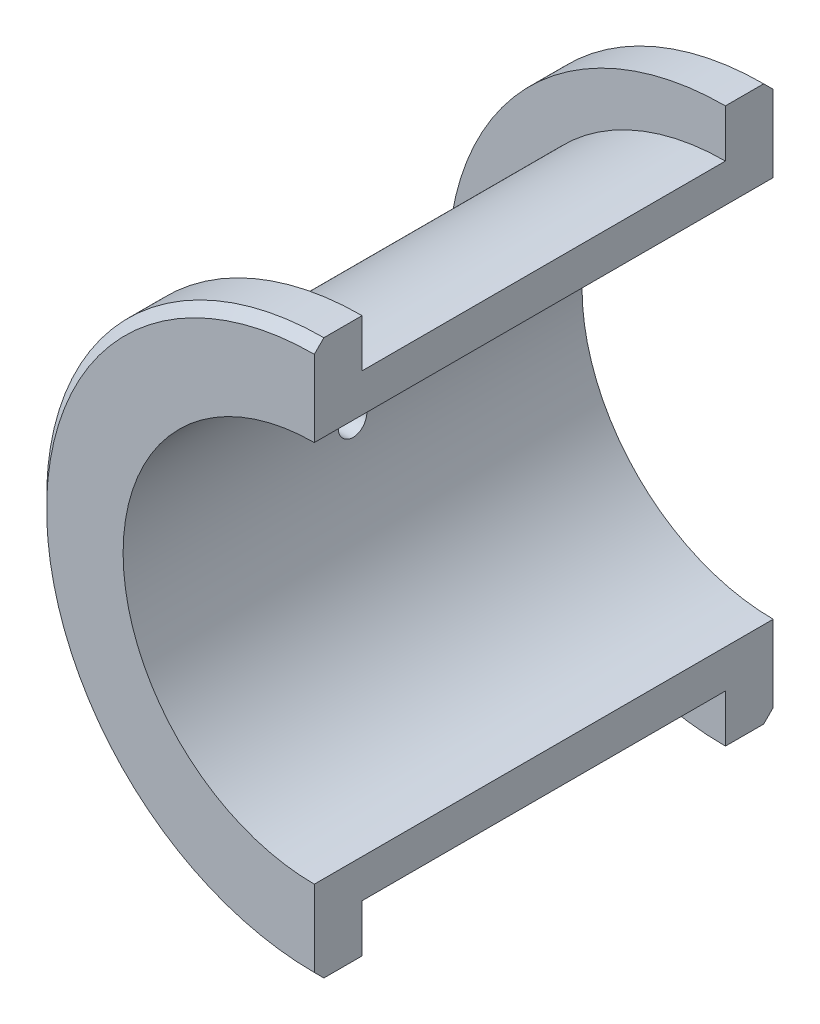
ISO-10303-21;
HEADER;
FILE_DESCRIPTION(('STEP AP214'),'2;1');
FILE_NAME('part.step','',(''),(''),'','','');
FILE_SCHEMA(('AUTOMOTIVE_DESIGN { 1 0 10303 214 1 1 1 1 }'));
ENDSEC;
DATA;
#1=APPLICATION_CONTEXT('core data for automotive mechanical design processes');
#2=APPLICATION_PROTOCOL_DEFINITION('international standard','automotive_design',2000,#1);
#3=PRODUCT_CONTEXT('',#1,'mechanical');
#4=PRODUCT('Part','Part','',(#3));
#5=PRODUCT_RELATED_PRODUCT_CATEGORY('part','',(#4));
#6=PRODUCT_DEFINITION_FORMATION('','',#4);
#7=PRODUCT_DEFINITION_CONTEXT('part definition',#1,'design');
#8=PRODUCT_DEFINITION('design','',#6,#7);
#9=PRODUCT_DEFINITION_SHAPE('','',#8);
#10=(LENGTH_UNIT() NAMED_UNIT(*) SI_UNIT(.MILLI.,.METRE.));
#11=(NAMED_UNIT(*) PLANE_ANGLE_UNIT() SI_UNIT($,.RADIAN.));
#12=(NAMED_UNIT(*) SI_UNIT($,.STERADIAN.) SOLID_ANGLE_UNIT());
#13=UNCERTAINTY_MEASURE_WITH_UNIT(LENGTH_MEASURE(1.E-05),#10,'distance_accuracy_value','');
#14=(GEOMETRIC_REPRESENTATION_CONTEXT(3) GLOBAL_UNCERTAINTY_ASSIGNED_CONTEXT((#13)) GLOBAL_UNIT_ASSIGNED_CONTEXT((#10,
#11,#12)) REPRESENTATION_CONTEXT('',''));
#15=CARTESIAN_POINT('',(0.,0.,0.));
#16=DIRECTION('',(0.,0.,1.));
#17=DIRECTION('',(1.,0.,0.));
#18=AXIS2_PLACEMENT_3D('',#15,#16,#17);
#19=CARTESIAN_POINT('',(0.,0.,24.));
#20=DIRECTION('',(0.,0.,-1.));
#21=DIRECTION('',(-1.,0.,0.));
#22=AXIS2_PLACEMENT_3D('',#19,#20,#21);
#23=CYLINDRICAL_SURFACE('',#22,24.);
#24=CARTESIAN_POINT('',(0.,0.,19.));
#25=DIRECTION('',(0.,0.,1.));
#26=DIRECTION('',(1.,0.,0.));
#27=AXIS2_PLACEMENT_3D('',#24,#25,#26);
#28=CIRCLE('',#27,24.);
#29=CARTESIAN_POINT('',(0.,24.,19.));
#30=VERTEX_POINT('',#29);
#31=CARTESIAN_POINT('',(0.,-24.,19.));
#32=VERTEX_POINT('',#31);
#33=EDGE_CURVE('E161',#30,#32,#28,.T.);
#34=ORIENTED_EDGE('',*,*,#33,.F.);
#35=DIRECTION('',(0.,0.,-1.));
#36=VECTOR('',#35,1.);
#37=CARTESIAN_POINT('',(0.,24.,24.));
#38=LINE('',#37,#36);
#39=CARTESIAN_POINT('',(0.,24.,-19.));
#40=VERTEX_POINT('',#39);
#41=EDGE_CURVE('E196',#30,#40,#38,.T.);
#42=ORIENTED_EDGE('',*,*,#41,.T.);
#43=CARTESIAN_POINT('',(0.,0.,-19.));
#44=DIRECTION('',(0.,0.,1.));
#45=DIRECTION('',(1.,0.,0.));
#46=AXIS2_PLACEMENT_3D('',#43,#44,#45);
#47=CIRCLE('',#46,24.);
#48=CARTESIAN_POINT('',(0.,-24.,-19.));
#49=VERTEX_POINT('',#48);
#50=EDGE_CURVE('E147',#40,#49,#47,.T.);
#51=ORIENTED_EDGE('',*,*,#50,.T.);
#52=DIRECTION('',(0.,0.,-1.));
#53=VECTOR('',#52,1.);
#54=CARTESIAN_POINT('',(0.,-24.,24.));
#55=LINE('',#54,#53);
#56=EDGE_CURVE('E135',#49,#32,#55,.F.);
#57=ORIENTED_EDGE('',*,*,#56,.T.);
#58=EDGE_LOOP('',(#34,#42,#51,#57));
#59=FACE_BOUND('',#58,.T.);
#60=CARTESIAN_POINT('',(-24.,0.,4.));
#61=CARTESIAN_POINT('',(-23.9999961787012,0.223025447933143,3.9999910576835));
#62=CARTESIAN_POINT('',(-23.9968588466085,0.446172610942113,3.98128436004973));
#63=CARTESIAN_POINT('',(-23.9846455190622,0.886208354676868,3.90698294597548));
#64=CARTESIAN_POINT('',(-23.9755640627822,1.10309098873479,3.85135430894143));
#65=CARTESIAN_POINT('',(-23.9524810917832,1.52416759554023,3.70493528225159));
#66=CARTESIAN_POINT('',(-23.9384836025471,1.72837178949104,3.61417365497508));
#67=CARTESIAN_POINT('',(-23.9071076333131,2.11862694716471,3.40014033271617));
#68=CARTESIAN_POINT('',(-23.8897295400709,2.30467998380575,3.2768723560272));
#69=CARTESIAN_POINT('',(-23.853333079333,2.65515618286669,3.00007186588727));
#70=CARTESIAN_POINT('',(-23.8343019490377,2.81938064565595,2.84628941658219));
#71=CARTESIAN_POINT('',(-23.7968420300277,3.11982159785588,2.5133632504435));
#72=CARTESIAN_POINT('',(-23.7784132794027,3.25603631902555,2.33421793366942));
#73=CARTESIAN_POINT('',(-23.7441210521565,3.49738740096821,1.95428645408471));
#74=CARTESIAN_POINT('',(-23.7282740654662,3.6023272845776,1.75337386111239));
#75=CARTESIAN_POINT('',(-23.7011166367148,3.77689338465795,1.336464697119));
#76=CARTESIAN_POINT('',(-23.6898058882289,3.84652198650498,1.12046914611579));
#77=CARTESIAN_POINT('',(-23.6731285894841,3.94786300445569,0.681631560229534));
#78=CARTESIAN_POINT('',(-23.6677082957712,3.97991844661664,0.45887082159777));
#79=CARTESIAN_POINT('',(-23.6632630229864,4.0062667604638,0.011071556986445));
#80=CARTESIAN_POINT('',(-23.6642375913154,4.00056230462239,-0.213966806667679));
#81=CARTESIAN_POINT('',(-23.6724228618169,3.95183215743384,-0.657484578040717));
#82=CARTESIAN_POINT('',(-23.6795691731027,3.90919181102364,-0.876007685672373));
#83=CARTESIAN_POINT('',(-23.6991919233761,3.78840502464551,-1.30275410852661));
#84=CARTESIAN_POINT('',(-23.7116685451723,3.71025736691159,-1.51097707022167));
#85=CARTESIAN_POINT('',(-23.7406156693456,3.52028359375026,-1.91236611750547));
#86=CARTESIAN_POINT('',(-23.7571050737172,3.40829746220754,-2.10545504972996));
#87=CARTESIAN_POINT('',(-23.7922066946401,3.15393922809189,-2.47024704086142));
#88=CARTESIAN_POINT('',(-23.8108190824686,3.01156467304686,-2.64194837192789));
#89=CARTESIAN_POINT('',(-23.8483524460766,2.69837153945449,-2.96132173729176));
#90=CARTESIAN_POINT('',(-23.8672743877064,2.527222342197,-3.10866962966413));
#91=CARTESIAN_POINT('',(-23.9030816223476,2.16245639837063,-3.37260442026454));
#92=CARTESIAN_POINT('',(-23.9199669022359,1.96883950705028,-3.48919112029316));
#93=CARTESIAN_POINT('',(-23.9498222862866,1.56432946586674,-3.68832356341805));
#94=CARTESIAN_POINT('',(-23.9627890945192,1.35342196090346,-3.77084067093001));
#95=CARTESIAN_POINT('',(-23.9833200482026,0.920477352964371,-3.89919074439356));
#96=CARTESIAN_POINT('',(-23.9908846456076,0.69844118268715,-3.94502677915795));
#97=CARTESIAN_POINT('',(-23.999698077483,0.252335842082598,-3.99827417353781));
#98=CARTESIAN_POINT('',(-24.0010200482045,0.0283211794416183,-4.00613051488897));
#99=CARTESIAN_POINT('',(-23.9973995907387,-0.41782363662382,-3.984381848915));
#100=CARTESIAN_POINT('',(-23.9924574035859,-0.639953862227262,-3.95477828298602));
#101=CARTESIAN_POINT('',(-23.9769092310112,-1.07464988087482,-3.85932024106323));
#102=CARTESIAN_POINT('',(-23.966337676821,-1.28726538941661,-3.7936860665758));
#103=CARTESIAN_POINT('',(-23.9407114312857,-1.69847501577671,-3.62826477088075));
#104=CARTESIAN_POINT('',(-23.9256564881923,-1.89706834545555,-3.52847573178357));
#105=CARTESIAN_POINT('',(-23.8925522608385,-2.27652910315033,-3.29655820048514));
#106=CARTESIAN_POINT('',(-23.8744776941924,-2.45722440149943,-3.1641517501324));
#107=CARTESIAN_POINT('',(-23.8374154782704,-2.7939897368043,-2.87114029538391));
#108=CARTESIAN_POINT('',(-23.8184277627448,-2.95005798351453,-2.71053324275733));
#109=CARTESIAN_POINT('',(-23.7814428037735,-3.2347884474528,-2.36368392308572));
#110=CARTESIAN_POINT('',(-23.7634578581937,-3.36315001778194,-2.17719333517694));
#111=CARTESIAN_POINT('',(-23.7307444764461,-3.58672369647198,-1.78503524937834));
#112=CARTESIAN_POINT('',(-23.7160159370563,-3.68193685563172,-1.57936835963601));
#113=CARTESIAN_POINT('',(-23.6915752591633,-3.83606133035704,-1.15553642750059));
#114=CARTESIAN_POINT('',(-23.681842468977,-3.89512229207671,-0.93742704795122));
#115=CARTESIAN_POINT('',(-23.6684434693642,-3.97573672604524,-0.494207793245183));
#116=CARTESIAN_POINT('',(-23.6647767325235,-3.99729345911387,-0.26909852842872));
#117=CARTESIAN_POINT('',(-23.6639477293442,-4.00219658567576,0.178728265539851));
#118=CARTESIAN_POINT('',(-23.6667049040904,-3.9860162178003,0.401440605720457));
#119=CARTESIAN_POINT('',(-23.6782365032597,-3.91692774233096,0.840926796881219));
#120=CARTESIAN_POINT('',(-23.6870109081794,-3.86401975377996,1.05770066710699));
#121=CARTESIAN_POINT('',(-23.7095577005075,-3.72315918335184,1.47897349966818));
#122=CARTESIAN_POINT('',(-23.7233242755147,-3.63524734496071,1.68348641608964));
#123=CARTESIAN_POINT('',(-23.7543099027553,-3.42692320626546,2.07493707071175));
#124=CARTESIAN_POINT('',(-23.7715291262144,-3.3065092939977,2.26187393659541));
#125=CARTESIAN_POINT('',(-23.80773526473,-3.03491021499545,2.61525693297241));
#126=CARTESIAN_POINT('',(-23.8267407292208,-2.88337690174984,2.78143362672044));
#127=CARTESIAN_POINT('',(-23.8642299577734,-2.55457445020837,3.0861625671599));
#128=CARTESIAN_POINT('',(-23.8827136004247,-2.37729938066022,3.22470842982107));
#129=CARTESIAN_POINT('',(-23.9172244742755,-2.00059067142445,3.47111722911991));
#130=CARTESIAN_POINT('',(-23.9332338600497,-1.80101246005251,3.57876166290072));
#131=CARTESIAN_POINT('',(-23.9608186816284,-1.38642091100637,3.75883117537587));
#132=CARTESIAN_POINT('',(-23.9723985308397,-1.17142319172802,3.83129132972752));
#133=CARTESIAN_POINT('',(-23.9872926533273,-0.796325296072641,3.92320843860266));
#134=CARTESIAN_POINT('',(-23.9920324363737,-0.638494128477516,3.95195915138554));
#135=CARTESIAN_POINT('',(-23.9983874557779,-0.320462896511695,3.9903579805516));
#136=CARTESIAN_POINT('',(-24.0000027459303,-0.160262872973591,4.00000642581978));
#137=CARTESIAN_POINT('',(-24.,0.,4.));
#138=B_SPLINE_CURVE_WITH_KNOTS('',3,(#60,#61,#62,#63,#64,#65,#66,#67,#68,#69,#70,#71,#72,#73,
#74,#75,#76,#77,#78,#79,#80,#81,#82,#83,#84,#85,#86,#87,#88,#89,#90,#91,#92,#93,#94,#95,#96,#97,
#98,#99,#100,#101,#102,#103,#104,#105,#106,#107,#108,#109,#110,#111,#112,#113,#114,#115,#116,
#117,#118,#119,#120,#121,#122,#123,#124,#125,#126,#127,#128,#129,#130,#131,#132,#133,#134,#135,
#136,#137),.UNSPECIFIED.,.T.,.F.,(4,2,2,2,2,2,2,2,2,2,2,2,2,2,2,2,2,2,2,2,2,2,2,2,2,2,2,2,2,2,2,
2,2,2,2,2,2,2,4),(0.,0.668490535901615,1.33759607311267,2.00615498724043,2.67463746027966,
3.34883985699731,4.02308480271771,4.70148033318144,5.3798300300189,6.05193723365478,
6.72399686913418,7.38912834816654,8.0542826404061,8.72263290612092,9.39103713088918,
10.0677243185812,10.7444158661736,11.4216750226545,12.0988775123384,12.7681261358624,
13.4373490085738,14.1025249121026,14.7677381732171,15.4388292100324,16.1099690088685,
16.7880611521219,17.4661317980151,18.1413763574683,18.8165622045859,19.4833265523632,
20.1500887390101,20.8160770916196,21.4820984804694,22.1560221470943,22.8301013420636,
23.5088357057152,24.1868920340812,24.6672679706243,25.1476356364315),.UNSPECIFIED.);
#139=CARTESIAN_POINT('',(-24.,0.,4.));
#140=VERTEX_POINT('',#139);
#141=EDGE_CURVE('E11',#140,#140,#138,.T.);
#142=ORIENTED_EDGE('',*,*,#141,.F.);
#143=EDGE_LOOP('',(#142));
#144=FACE_BOUND('',#143,.T.);
#145=ADVANCED_FACE('F36',(#59,#144),#23,.T.);
#146=CARTESIAN_POINT('',(0.,0.,19.));
#147=DIRECTION('',(0.,0.,1.));
#148=DIRECTION('',(1.,0.,0.));
#149=AXIS2_PLACEMENT_3D('',#146,#147,#148);
#150=CYLINDRICAL_SURFACE('',#149,29.);
#151=DIRECTION('',(0.,0.,1.));
#152=VECTOR('',#151,1.);
#153=CARTESIAN_POINT('',(0.,-29.,-24.));
#154=LINE('',#153,#152);
#155=CARTESIAN_POINT('',(0.,-29.,19.));
#156=VERTEX_POINT('',#155);
#157=CARTESIAN_POINT('',(0.,-29.,23.));
#158=VERTEX_POINT('',#157);
#159=EDGE_CURVE('E129',#156,#158,#154,.T.);
#160=ORIENTED_EDGE('',*,*,#159,.T.);
#161=CARTESIAN_POINT('',(0.,0.,23.));
#162=DIRECTION('',(0.,0.,1.));
#163=DIRECTION('',(1.,0.,0.));
#164=AXIS2_PLACEMENT_3D('',#161,#162,#163);
#165=CIRCLE('',#164,29.);
#166=CARTESIAN_POINT('',(0.,29.,23.));
#167=VERTEX_POINT('',#166);
#168=EDGE_CURVE('E48',#158,#167,#165,.F.);
#169=ORIENTED_EDGE('',*,*,#168,.T.);
#170=DIRECTION('',(0.,0.,1.));
#171=VECTOR('',#170,1.);
#172=CARTESIAN_POINT('',(0.,29.,-24.));
#173=LINE('',#172,#171);
#174=CARTESIAN_POINT('',(0.,29.,19.));
#175=VERTEX_POINT('',#174);
#176=EDGE_CURVE('E128',#175,#167,#173,.T.);
#177=ORIENTED_EDGE('',*,*,#176,.F.);
#178=CARTESIAN_POINT('',(0.,0.,19.));
#179=DIRECTION('',(0.,0.,1.));
#180=DIRECTION('',(1.,0.,0.));
#181=AXIS2_PLACEMENT_3D('',#178,#179,#180);
#182=CIRCLE('',#181,29.);
#183=EDGE_CURVE('E155',#175,#156,#182,.T.);
#184=ORIENTED_EDGE('',*,*,#183,.T.);
#185=EDGE_LOOP('',(#160,#169,#177,#184));
#186=FACE_BOUND('',#185,.T.);
#187=ADVANCED_FACE('F209',(#186),#150,.T.);
#188=CARTESIAN_POINT('',(0.,0.,24.));
#189=DIRECTION('',(0.,0.,1.));
#190=DIRECTION('',(1.,0.,0.));
#191=AXIS2_PLACEMENT_3D('',#188,#189,#190);
#192=PLANE('',#191);
#193=DIRECTION('',(0.,-1.,0.));
#194=VECTOR('',#193,1.);
#195=CARTESIAN_POINT('',(0.,-29.,24.));
#196=LINE('',#195,#194);
#197=CARTESIAN_POINT('',(0.,28.,24.));
#198=VERTEX_POINT('',#197);
#199=CARTESIAN_POINT('',(0.,20.,24.));
#200=VERTEX_POINT('',#199);
#201=EDGE_CURVE('E183',#198,#200,#196,.T.);
#202=ORIENTED_EDGE('',*,*,#201,.F.);
#203=CARTESIAN_POINT('',(0.,0.,24.));
#204=DIRECTION('',(0.,0.,1.));
#205=DIRECTION('',(1.,0.,0.));
#206=AXIS2_PLACEMENT_3D('',#203,#204,#205);
#207=CIRCLE('',#206,28.);
#208=CARTESIAN_POINT('',(0.,-28.,24.));
#209=VERTEX_POINT('',#208);
#210=EDGE_CURVE('E174',#198,#209,#207,.T.);
#211=ORIENTED_EDGE('',*,*,#210,.T.);
#212=CARTESIAN_POINT('',(0.,-20.,24.));
#213=VERTEX_POINT('',#212);
#214=EDGE_CURVE('E182',#213,#209,#196,.T.);
#215=ORIENTED_EDGE('',*,*,#214,.F.);
#216=CARTESIAN_POINT('',(0.,0.,24.));
#217=DIRECTION('',(0.,0.,1.));
#218=DIRECTION('',(1.,0.,0.));
#219=AXIS2_PLACEMENT_3D('',#216,#217,#218);
#220=CIRCLE('',#219,20.);
#221=EDGE_CURVE('E158',#200,#213,#220,.T.);
#222=ORIENTED_EDGE('',*,*,#221,.F.);
#223=EDGE_LOOP('',(#202,#211,#215,#222));
#224=FACE_BOUND('',#223,.T.);
#225=ADVANCED_FACE('F180',(#224),#192,.T.);
#226=CARTESIAN_POINT('',(0.,0.,24.));
#227=DIRECTION('',(0.,0.,-1.));
#228=DIRECTION('',(-1.,0.,0.));
#229=AXIS2_PLACEMENT_3D('',#226,#227,#228);
#230=CYLINDRICAL_SURFACE('',#229,20.);
#231=CARTESIAN_POINT('',(-20.,0.,-1.5));
#232=CARTESIAN_POINT('',(-19.9999992582729,0.0841288095114431,-1.49999631318298));
#233=CARTESIAN_POINT('',(-19.9994635090758,0.168315601024087,-1.49289854655941));
#234=CARTESIAN_POINT('',(-19.9973778078798,0.334361941971538,-1.46468751545672));
#235=CARTESIAN_POINT('',(-19.9958266932389,0.416218711162994,-1.44355818376302));
#236=CARTESIAN_POINT('',(-19.9918856268593,0.575175965959818,-1.38789667188027));
#237=CARTESIAN_POINT('',(-19.9894961359011,0.652279036935091,-1.3533718528915));
#238=CARTESIAN_POINT('',(-19.9841466247064,0.799576480678019,-1.27191204713627));
#239=CARTESIAN_POINT('',(-19.9811867302827,0.86977237179985,-1.22497979620403));
#240=CARTESIAN_POINT('',(-19.975021868989,1.00142895753255,-1.11993077946249));
#241=CARTESIAN_POINT('',(-19.971816458291,1.06287322971852,-1.06179345591578));
#242=CARTESIAN_POINT('',(-19.9655255838438,1.17514165369782,-0.936027702655082));
#243=CARTESIAN_POINT('',(-19.9624401252546,1.22596534904266,-0.868398865225933));
#244=CARTESIAN_POINT('',(-19.9567335395977,1.31560383874766,-0.725472545190602));
#245=CARTESIAN_POINT('',(-19.954112961772,1.35440446810332,-0.650166154969908));
#246=CARTESIAN_POINT('',(-19.9496376121017,1.41880489046782,-0.494084627656202));
#247=CARTESIAN_POINT('',(-19.947782829037,1.44440487688688,-0.41330957070739));
#248=CARTESIAN_POINT('',(-19.9450525889002,1.48163037657928,-0.248746107599445));
#249=CARTESIAN_POINT('',(-19.9441752805014,1.49328231044217,-0.164963709192381));
#250=CARTESIAN_POINT('',(-19.9434933892539,1.50236254574838,0.00337195326069861));
#251=CARTESIAN_POINT('',(-19.943688789744,1.49979106810858,0.0879252053135138));
#252=CARTESIAN_POINT('',(-19.9451285636931,1.48051934417569,0.255221811053888));
#253=CARTESIAN_POINT('',(-19.9463708093904,1.46384775676394,0.337968486964174));
#254=CARTESIAN_POINT('',(-19.9497609519804,1.4168935522692,0.499485697115581));
#255=CARTESIAN_POINT('',(-19.9519088562398,1.38661082447336,0.578256199008755));
#256=CARTESIAN_POINT('',(-19.9568707353614,1.31326167189701,0.729676716238837));
#257=CARTESIAN_POINT('',(-19.9596853828031,1.27018232726496,0.802320450176808));
#258=CARTESIAN_POINT('',(-19.9656629459514,1.17247213743423,0.939356662864872));
#259=CARTESIAN_POINT('',(-19.9688258673499,1.11784110342877,1.00374900672235));
#260=CARTESIAN_POINT('',(-19.9751530336147,0.998417278432274,1.12262125824358));
#261=CARTESIAN_POINT('',(-19.978317262423,0.933599700176314,1.17707626759472));
#262=CARTESIAN_POINT('',(-19.9842830152099,0.795729375934442,1.2743357635657));
#263=CARTESIAN_POINT('',(-19.9870845390023,0.72267662571859,1.31714024420127));
#264=CARTESIAN_POINT('',(-19.9920096041928,0.570393940216334,1.38988183024377));
#265=CARTESIAN_POINT('',(-19.9941330911371,0.491163509428978,1.41981790224129));
#266=CARTESIAN_POINT('',(-19.9974621500133,0.328781652774543,1.46595581220485));
#267=CARTESIAN_POINT('',(-19.998667737375,0.245630292842573,1.48215788103766));
#268=CARTESIAN_POINT('',(-20.0000231735387,0.0779828437837497,1.50033680953895));
#269=CARTESIAN_POINT('',(-20.0001755757578,-0.00650949482532217,1.50234807465418));
#270=CARTESIAN_POINT('',(-19.9994142771364,-0.174630230993065,1.49217833193029));
#271=CARTESIAN_POINT('',(-19.9985005843262,-0.258258635054598,1.47999743099469));
#272=CARTESIAN_POINT('',(-19.9957115375324,-0.422180011176505,1.44181763118942));
#273=CARTESIAN_POINT('',(-19.9938372886011,-0.502476701646071,1.41583460944133));
#274=CARTESIAN_POINT('',(-19.989337809084,-0.65757032738403,1.35080430636328));
#275=CARTESIAN_POINT('',(-19.9867125688255,-0.732367191799398,1.31175685676318));
#276=CARTESIAN_POINT('',(-19.9809993255836,-0.87449495937676,1.22161916210213));
#277=CARTESIAN_POINT('',(-19.9779104477497,-0.941811320255548,1.17050604328117));
#278=CARTESIAN_POINT('',(-19.9716201639251,-1.06692059601702,1.05772107453092));
#279=CARTESIAN_POINT('',(-19.9684187563498,-1.1247133767348,0.996049075876741));
#280=CARTESIAN_POINT('',(-19.9622567375937,-1.22925234979154,0.863748059867883));
#281=CARTESIAN_POINT('',(-19.9592966224009,-1.27597614708765,0.793101320567015));
#282=CARTESIAN_POINT('',(-19.9539590285433,-1.35689744472608,0.644944801618456));
#283=CARTESIAN_POINT('',(-19.951581545017,-1.39109504958689,0.567435079242164));
#284=CARTESIAN_POINT('',(-19.9476809567371,-1.44595479238458,0.407833192512691));
#285=CARTESIAN_POINT('',(-19.9461569763152,-1.46663080672911,0.325745820147273));
#286=CARTESIAN_POINT('',(-19.9441328652441,-1.49390569339177,0.159252768984275));
#287=CARTESIAN_POINT('',(-19.9436327190765,-1.50050477907388,0.0748471253443678));
#288=CARTESIAN_POINT('',(-19.9437130691626,-1.49943621553155,-0.0936639132474086));
#289=CARTESIAN_POINT('',(-19.9442908995857,-1.49180376085723,-0.177769534896141));
#290=CARTESIAN_POINT('',(-19.9464564369575,-1.46256198193398,-0.343501083710002));
#291=CARTESIAN_POINT('',(-19.9480441455862,-1.44095263443385,-0.425127006749805));
#292=CARTESIAN_POINT('',(-19.952049853556,-1.38437900273526,-0.583585608421792));
#293=CARTESIAN_POINT('',(-19.9544678255495,-1.34941515840954,-0.660418444832537));
#294=CARTESIAN_POINT('',(-19.9598616237908,-1.26712924619683,-0.807128957714564));
#295=CARTESIAN_POINT('',(-19.9628374388208,-1.21980742681008,-0.877006774001796));
#296=CARTESIAN_POINT('',(-19.9690203079162,-1.11401708946727,-1.00800334997103));
#297=CARTESIAN_POINT('',(-19.972227887963,-1.05552268820001,-1.0691011816401));
#298=CARTESIAN_POINT('',(-19.9785081329158,-0.929090973452718,-1.18063405031084));
#299=CARTESIAN_POINT('',(-19.9815807648333,-0.861151367795686,-1.23106649150607));
#300=CARTESIAN_POINT('',(-19.9872494022766,-0.717650416603838,-1.31989116253911));
#301=CARTESIAN_POINT('',(-19.9898446437752,-0.642077148267444,-1.35826416049103));
#302=CARTESIAN_POINT('',(-19.9942566719576,-0.485593917915209,-1.42172828444031));
#303=CARTESIAN_POINT('',(-19.9960743603405,-0.404690263737666,-1.44683480306826));
#304=CARTESIAN_POINT('',(-19.9982556200579,-0.26941791672437,-1.47660198852695));
#305=CARTESIAN_POINT('',(-19.9989068154638,-0.215921192938043,-1.48536471878942));
#306=CARTESIAN_POINT('',(-19.9997792437292,-0.108290987947989,-1.49706490515231));
#307=CARTESIAN_POINT('',(-20.0000004774832,-0.0541575080690682,-1.50000237337036));
#308=CARTESIAN_POINT('',(-20.,0.,-1.5));
#309=B_SPLINE_CURVE_WITH_KNOTS('',3,(#231,#232,#233,#234,#235,#236,#237,#238,#239,#240,#241,
#242,#243,#244,#245,#246,#247,#248,#249,#250,#251,#252,#253,#254,#255,#256,#257,#258,#259,#260,
#261,#262,#263,#264,#265,#266,#267,#268,#269,#270,#271,#272,#273,#274,#275,#276,#277,#278,#279,
#280,#281,#282,#283,#284,#285,#286,#287,#288,#289,#290,#291,#292,#293,#294,#295,#296,#297,#298,
#299,#300,#301,#302,#303,#304,#305,#306,#307,#308),.UNSPECIFIED.,.T.,.F.,(4,2,2,2,2,2,2,2,2,2,2,
2,2,2,2,2,2,2,2,2,2,2,2,2,2,2,2,2,2,2,2,2,2,2,2,2,2,2,4),(0.,0.252188706341403,
0.504666687116075,0.757006120137034,1.00928995874569,1.2620411413344,1.51480318436672,
1.76786189721255,2.02091690224424,2.27349180470371,2.52606278420137,2.7781216361643,
3.0301825384079,3.28249879898397,3.53481918386621,3.78776333637314,4.04070761880367,
4.29367221036427,4.54663254953898,4.79897937776532,5.05132430518305,5.30337957695229,
5.55543809532427,5.80797835211939,6.06052216631005,6.31357265115638,6.56662102450254,
6.81940930006921,7.07219374409736,7.32435388202406,7.57651443943157,7.828666691847,
8.08081387425119,8.33355244628146,8.58635246072108,8.83955360771711,9.09246032562223,
9.25480590484755,9.41715114636383),.UNSPECIFIED.);
#310=CARTESIAN_POINT('',(-20.,0.,-1.5));
#311=VERTEX_POINT('',#310);
#312=EDGE_CURVE('E239',#311,#311,#309,.T.);
#313=ORIENTED_EDGE('',*,*,#312,.F.);
#314=EDGE_LOOP('',(#313));
#315=FACE_BOUND('',#314,.T.);
#316=DIRECTION('',(0.,0.,-1.));
#317=VECTOR('',#316,1.);
#318=CARTESIAN_POINT('',(0.,20.,24.));
#319=LINE('',#318,#317);
#320=CARTESIAN_POINT('',(0.,20.,-24.));
#321=VERTEX_POINT('',#320);
#322=EDGE_CURVE('E144',#200,#321,#319,.T.);
#323=ORIENTED_EDGE('',*,*,#322,.F.);
#324=ORIENTED_EDGE('',*,*,#221,.T.);
#325=DIRECTION('',(0.,0.,-1.));
#326=VECTOR('',#325,1.);
#327=CARTESIAN_POINT('',(0.,-20.,24.));
#328=LINE('',#327,#326);
#329=CARTESIAN_POINT('',(0.,-20.,-24.));
#330=VERTEX_POINT('',#329);
#331=EDGE_CURVE('E150',#330,#213,#328,.F.);
#332=ORIENTED_EDGE('',*,*,#331,.F.);
#333=CARTESIAN_POINT('',(0.,0.,-24.));
#334=DIRECTION('',(0.,0.,1.));
#335=DIRECTION('',(1.,0.,0.));
#336=AXIS2_PLACEMENT_3D('',#333,#334,#335);
#337=CIRCLE('',#336,20.);
#338=EDGE_CURVE('E143',#321,#330,#337,.T.);
#339=ORIENTED_EDGE('',*,*,#338,.F.);
#340=EDGE_LOOP('',(#323,#324,#332,#339));
#341=FACE_BOUND('',#340,.T.);
#342=ADVANCED_FACE('F233',(#315,#341),#230,.F.);
#343=CARTESIAN_POINT('',(0.,0.,19.));
#344=DIRECTION('',(0.,0.,1.));
#345=DIRECTION('',(1.,0.,0.));
#346=AXIS2_PLACEMENT_3D('',#343,#344,#345);
#347=PLANE('',#346);
#348=ORIENTED_EDGE('',*,*,#183,.F.);
#349=DIRECTION('',(0.,-1.,0.));
#350=VECTOR('',#349,1.);
#351=CARTESIAN_POINT('',(0.,0.,19.));
#352=LINE('',#351,#350);
#353=EDGE_CURVE('E200',#175,#30,#352,.T.);
#354=ORIENTED_EDGE('',*,*,#353,.T.);
#355=ORIENTED_EDGE('',*,*,#33,.T.);
#356=EDGE_CURVE('E203',#32,#156,#352,.T.);
#357=ORIENTED_EDGE('',*,*,#356,.T.);
#358=EDGE_LOOP('',(#348,#354,#355,#357));
#359=FACE_BOUND('',#358,.T.);
#360=ADVANCED_FACE('F207',(#359),#347,.F.);
#361=CARTESIAN_POINT('',(0.,0.,-24.));
#362=DIRECTION('',(0.,0.,-1.));
#363=DIRECTION('',(1.,0.,0.));
#364=AXIS2_PLACEMENT_3D('',#361,#362,#363);
#365=PLANE('',#364);
#366=DIRECTION('',(0.,-1.,0.));
#367=VECTOR('',#366,1.);
#368=CARTESIAN_POINT('',(0.,-29.,-24.));
#369=LINE('',#368,#367);
#370=CARTESIAN_POINT('',(0.,-28.,-24.));
#371=VERTEX_POINT('',#370);
#372=EDGE_CURVE('E188',#330,#371,#369,.T.);
#373=ORIENTED_EDGE('',*,*,#372,.T.);
#374=CARTESIAN_POINT('',(0.,0.,-24.));
#375=DIRECTION('',(0.,0.,-1.));
#376=DIRECTION('',(-1.,0.,0.));
#377=AXIS2_PLACEMENT_3D('',#374,#375,#376);
#378=CIRCLE('',#377,28.);
#379=CARTESIAN_POINT('',(0.,28.,-24.));
#380=VERTEX_POINT('',#379);
#381=EDGE_CURVE('E169',#371,#380,#378,.T.);
#382=ORIENTED_EDGE('',*,*,#381,.T.);
#383=EDGE_CURVE('E194',#380,#321,#369,.T.);
#384=ORIENTED_EDGE('',*,*,#383,.T.);
#385=ORIENTED_EDGE('',*,*,#338,.T.);
#386=EDGE_LOOP('',(#373,#382,#384,#385));
#387=FACE_BOUND('',#386,.T.);
#388=ADVANCED_FACE('F261',(#387),#365,.T.);
#389=CARTESIAN_POINT('',(0.,0.,-19.));
#390=DIRECTION('',(0.,0.,-1.));
#391=DIRECTION('',(1.,0.,0.));
#392=AXIS2_PLACEMENT_3D('',#389,#390,#391);
#393=CYLINDRICAL_SURFACE('',#392,29.);
#394=CARTESIAN_POINT('',(0.,29.,-23.));
#395=VERTEX_POINT('',#394);
#396=CARTESIAN_POINT('',(0.,29.,-19.));
#397=VERTEX_POINT('',#396);
#398=EDGE_CURVE('E195',#395,#397,#173,.T.);
#399=ORIENTED_EDGE('',*,*,#398,.F.);
#400=CARTESIAN_POINT('',(0.,0.,-23.));
#401=DIRECTION('',(0.,0.,-1.));
#402=DIRECTION('',(-1.,0.,0.));
#403=AXIS2_PLACEMENT_3D('',#400,#401,#402);
#404=CIRCLE('',#403,29.);
#405=CARTESIAN_POINT('',(0.,-29.,-23.));
#406=VERTEX_POINT('',#405);
#407=EDGE_CURVE('E126',#395,#406,#404,.F.);
#408=ORIENTED_EDGE('',*,*,#407,.T.);
#409=CARTESIAN_POINT('',(0.,-29.,-19.));
#410=VERTEX_POINT('',#409);
#411=EDGE_CURVE('E119',#406,#410,#154,.T.);
#412=ORIENTED_EDGE('',*,*,#411,.T.);
#413=CARTESIAN_POINT('',(0.,0.,-19.));
#414=DIRECTION('',(0.,0.,1.));
#415=DIRECTION('',(1.,0.,0.));
#416=AXIS2_PLACEMENT_3D('',#413,#414,#415);
#417=CIRCLE('',#416,29.);
#418=EDGE_CURVE('E124',#397,#410,#417,.T.);
#419=ORIENTED_EDGE('',*,*,#418,.F.);
#420=EDGE_LOOP('',(#399,#408,#412,#419));
#421=FACE_BOUND('',#420,.T.);
#422=ADVANCED_FACE('F122',(#421),#393,.T.);
#423=CARTESIAN_POINT('',(0.,0.,-19.));
#424=DIRECTION('',(0.,0.,-1.));
#425=DIRECTION('',(1.,0.,0.));
#426=AXIS2_PLACEMENT_3D('',#423,#424,#425);
#427=PLANE('',#426);
#428=ORIENTED_EDGE('',*,*,#418,.T.);
#429=DIRECTION('',(0.,1.,0.));
#430=VECTOR('',#429,1.);
#431=CARTESIAN_POINT('',(0.,0.,-19.));
#432=LINE('',#431,#430);
#433=EDGE_CURVE('E132',#410,#49,#432,.T.);
#434=ORIENTED_EDGE('',*,*,#433,.T.);
#435=ORIENTED_EDGE('',*,*,#50,.F.);
#436=EDGE_CURVE('E139',#40,#397,#432,.T.);
#437=ORIENTED_EDGE('',*,*,#436,.T.);
#438=EDGE_LOOP('',(#428,#434,#435,#437));
#439=FACE_BOUND('',#438,.T.);
#440=ADVANCED_FACE('F142',(#439),#427,.F.);
#441=CARTESIAN_POINT('',(0.,-29.,-24.));
#442=DIRECTION('',(-1.,0.,0.));
#443=DIRECTION('',(0.,0.,1.));
#444=AXIS2_PLACEMENT_3D('',#441,#442,#443);
#445=PLANE('',#444);
#446=ORIENTED_EDGE('',*,*,#383,.F.);
#447=DIRECTION('',(0.,-0.707106781186547,-0.707106781186548));
#448=VECTOR('',#447,1.);
#449=CARTESIAN_POINT('',(0.,0.,-52.));
#450=LINE('',#449,#448);
#451=EDGE_CURVE('E172',#380,#395,#450,.F.);
#452=ORIENTED_EDGE('',*,*,#451,.T.);
#453=ORIENTED_EDGE('',*,*,#398,.T.);
#454=ORIENTED_EDGE('',*,*,#436,.F.);
#455=ORIENTED_EDGE('',*,*,#41,.F.);
#456=ORIENTED_EDGE('',*,*,#353,.F.);
#457=ORIENTED_EDGE('',*,*,#176,.T.);
#458=DIRECTION('',(0.,0.707106781186544,-0.707106781186551));
#459=VECTOR('',#458,1.);
#460=CARTESIAN_POINT('',(0.,0.,52.0000000000003));
#461=LINE('',#460,#459);
#462=EDGE_CURVE('E55',#167,#198,#461,.F.);
#463=ORIENTED_EDGE('',*,*,#462,.T.);
#464=ORIENTED_EDGE('',*,*,#201,.T.);
#465=ORIENTED_EDGE('',*,*,#322,.T.);
#466=EDGE_LOOP('',(#446,#452,#453,#454,#455,#456,#457,#463,#464,#465));
#467=FACE_BOUND('',#466,.T.);
#468=ADVANCED_FACE('F211',(#467),#445,.F.);
#469=ORIENTED_EDGE('',*,*,#411,.F.);
#470=DIRECTION('',(0.,-0.707106781186547,0.707106781186548));
#471=VECTOR('',#470,1.);
#472=CARTESIAN_POINT('',(0.,0.,-52.));
#473=LINE('',#472,#471);
#474=EDGE_CURVE('E167',#406,#371,#473,.F.);
#475=ORIENTED_EDGE('',*,*,#474,.T.);
#476=ORIENTED_EDGE('',*,*,#372,.F.);
#477=ORIENTED_EDGE('',*,*,#331,.T.);
#478=ORIENTED_EDGE('',*,*,#214,.T.);
#479=DIRECTION('',(0.,0.707106781186544,0.707106781186551));
#480=VECTOR('',#479,1.);
#481=CARTESIAN_POINT('',(0.,0.,52.0000000000003));
#482=LINE('',#481,#480);
#483=EDGE_CURVE('E165',#209,#158,#482,.F.);
#484=ORIENTED_EDGE('',*,*,#483,.T.);
#485=ORIENTED_EDGE('',*,*,#159,.F.);
#486=ORIENTED_EDGE('',*,*,#356,.F.);
#487=ORIENTED_EDGE('',*,*,#56,.F.);
#488=ORIENTED_EDGE('',*,*,#433,.F.);
#489=EDGE_LOOP('',(#469,#475,#476,#477,#478,#484,#485,#486,#487,#488));
#490=FACE_BOUND('',#489,.T.);
#491=ADVANCED_FACE('F133',(#490),#445,.F.);
#492=CARTESIAN_POINT('',(0.,0.,-23.));
#493=DIRECTION('',(0.,0.,1.));
#494=DIRECTION('',(1.,0.,0.));
#495=AXIS2_PLACEMENT_3D('',#492,#493,#494);
#496=CONICAL_SURFACE('',#495,29.,0.785398163397448);
#497=ORIENTED_EDGE('',*,*,#451,.F.);
#498=ORIENTED_EDGE('',*,*,#381,.F.);
#499=ORIENTED_EDGE('',*,*,#474,.F.);
#500=ORIENTED_EDGE('',*,*,#407,.F.);
#501=EDGE_LOOP('',(#497,#498,#499,#500));
#502=FACE_BOUND('',#501,.T.);
#503=ADVANCED_FACE('F214',(#502),#496,.T.);
#504=CARTESIAN_POINT('',(0.,0.,24.));
#505=DIRECTION('',(0.,0.,-1.));
#506=DIRECTION('',(-1.,0.,0.));
#507=AXIS2_PLACEMENT_3D('',#504,#505,#506);
#508=CONICAL_SURFACE('',#507,28.,0.785398163397443);
#509=ORIENTED_EDGE('',*,*,#462,.F.);
#510=ORIENTED_EDGE('',*,*,#168,.F.);
#511=ORIENTED_EDGE('',*,*,#483,.F.);
#512=ORIENTED_EDGE('',*,*,#210,.F.);
#513=EDGE_LOOP('',(#509,#510,#511,#512));
#514=FACE_BOUND('',#513,.T.);
#515=ADVANCED_FACE('F38',(#514),#508,.T.);
#516=CARTESIAN_POINT('',(0.001000000000001,0.,0.));
#517=DIRECTION('',(-1.,0.,0.));
#518=DIRECTION('',(0.,0.,1.));
#519=AXIS2_PLACEMENT_3D('',#516,#517,#518);
#520=CYLINDRICAL_SURFACE('',#519,4.);
#521=CARTESIAN_POINT('',(-30.,0.,0.));
#522=DIRECTION('',(1.,0.,0.));
#523=DIRECTION('',(0.,0.,-1.));
#524=AXIS2_PLACEMENT_3D('',#521,#522,#523);
#525=CIRCLE('',#524,4.);
#526=CARTESIAN_POINT('',(-30.,0.,-4.));
#527=VERTEX_POINT('',#526);
#528=EDGE_CURVE('E186',#527,#527,#525,.T.);
#529=ORIENTED_EDGE('',*,*,#528,.T.);
#530=EDGE_LOOP('',(#529));
#531=FACE_BOUND('',#530,.T.);
#532=ORIENTED_EDGE('',*,*,#141,.T.);
#533=EDGE_LOOP('',(#532));
#534=FACE_BOUND('',#533,.T.);
#535=ADVANCED_FACE('F213',(#531,#534),#520,.T.);
#536=CARTESIAN_POINT('',(-30.,0.,0.));
#537=DIRECTION('',(1.,0.,0.));
#538=DIRECTION('',(0.,0.,-1.));
#539=AXIS2_PLACEMENT_3D('',#536,#537,#538);
#540=PLANE('',#539);
#541=ORIENTED_EDGE('',*,*,#528,.F.);
#542=EDGE_LOOP('',(#541));
#543=FACE_BOUND('',#542,.T.);
#544=CARTESIAN_POINT('',(-30.,0.,0.));
#545=DIRECTION('',(1.,0.,0.));
#546=DIRECTION('',(0.,0.,-1.));
#547=AXIS2_PLACEMENT_3D('',#544,#545,#546);
#548=CIRCLE('',#547,1.5);
#549=CARTESIAN_POINT('',(-30.,0.,-1.5));
#550=VERTEX_POINT('',#549);
#551=EDGE_CURVE('E190',#550,#550,#548,.T.);
#552=ORIENTED_EDGE('',*,*,#551,.T.);
#553=EDGE_LOOP('',(#552));
#554=FACE_BOUND('',#553,.T.);
#555=ADVANCED_FACE('F219',(#543,#554),#540,.F.);
#556=CARTESIAN_POINT('',(0.001000000000001,0.,0.));
#557=DIRECTION('',(-1.,0.,0.));
#558=DIRECTION('',(0.,0.,1.));
#559=AXIS2_PLACEMENT_3D('',#556,#557,#558);
#560=CYLINDRICAL_SURFACE('',#559,1.5);
#561=ORIENTED_EDGE('',*,*,#551,.F.);
#562=EDGE_LOOP('',(#561));
#563=FACE_BOUND('',#562,.T.);
#564=ORIENTED_EDGE('',*,*,#312,.T.);
#565=EDGE_LOOP('',(#564));
#566=FACE_BOUND('',#565,.T.);
#567=ADVANCED_FACE('F247',(#563,#566),#560,.F.);
#568=CLOSED_SHELL('',(#145,#187,#225,#342,#360,#388,#422,#440,#468,#491,#503,#515,#535,#555,#567));
#569=MANIFOLD_SOLID_BREP('B2',#568);
#570=ADVANCED_BREP_SHAPE_REPRESENTATION('',(#18,#569),#14);
#571=SHAPE_DEFINITION_REPRESENTATION(#9,#570);
ENDSEC;
END-ISO-10303-21;
